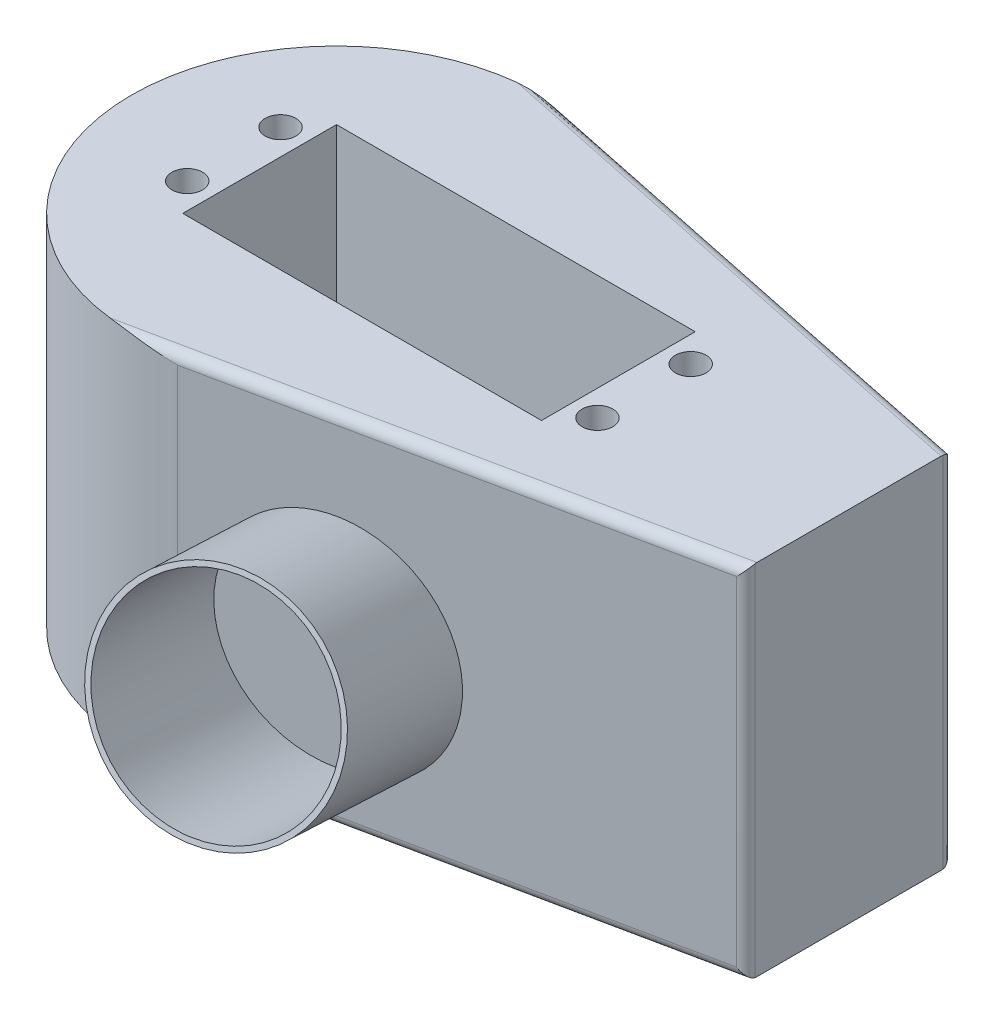
ISO-10303-21;
HEADER;
FILE_DESCRIPTION(('STEP AP214'),'2;1');
FILE_NAME('part.step','',(''),(''),'','','');
FILE_SCHEMA(('AUTOMOTIVE_DESIGN { 1 0 10303 214 1 1 1 1 }'));
ENDSEC;
DATA;
#1=APPLICATION_CONTEXT('core data for automotive mechanical design processes');
#2=APPLICATION_PROTOCOL_DEFINITION('international standard','automotive_design',2000,#1);
#3=PRODUCT_CONTEXT('',#1,'mechanical');
#4=PRODUCT('Part','Part','',(#3));
#5=PRODUCT_RELATED_PRODUCT_CATEGORY('part','',(#4));
#6=PRODUCT_DEFINITION_FORMATION('','',#4);
#7=PRODUCT_DEFINITION_CONTEXT('part definition',#1,'design');
#8=PRODUCT_DEFINITION('design','',#6,#7);
#9=PRODUCT_DEFINITION_SHAPE('','',#8);
#10=(LENGTH_UNIT() NAMED_UNIT(*) SI_UNIT(.MILLI.,.METRE.));
#11=(NAMED_UNIT(*) PLANE_ANGLE_UNIT() SI_UNIT($,.RADIAN.));
#12=(NAMED_UNIT(*) SI_UNIT($,.STERADIAN.) SOLID_ANGLE_UNIT());
#13=UNCERTAINTY_MEASURE_WITH_UNIT(LENGTH_MEASURE(1.E-05),#10,'distance_accuracy_value','');
#14=(GEOMETRIC_REPRESENTATION_CONTEXT(3) GLOBAL_UNCERTAINTY_ASSIGNED_CONTEXT((#13)) GLOBAL_UNIT_ASSIGNED_CONTEXT((#10,
#11,#12)) REPRESENTATION_CONTEXT('',''));
#15=CARTESIAN_POINT('',(0.,0.,0.));
#16=DIRECTION('',(0.,0.,1.));
#17=DIRECTION('',(1.,0.,0.));
#18=AXIS2_PLACEMENT_3D('',#15,#16,#17);
#19=CARTESIAN_POINT('',(0.,35.,0.));
#20=DIRECTION('',(0.,-1.,0.));
#21=DIRECTION('',(0.,0.,-1.));
#22=AXIS2_PLACEMENT_3D('',#19,#20,#21);
#23=CYLINDRICAL_SURFACE('',#22,20.);
#24=CARTESIAN_POINT('',(0.,35.,0.));
#25=DIRECTION('',(0.,1.,0.));
#26=DIRECTION('',(0.,0.,1.));
#27=AXIS2_PLACEMENT_3D('',#24,#25,#26);
#28=CIRCLE('',#27,20.);
#29=CARTESIAN_POINT('',(-2.2333107920081,35.,-19.8749169282868));
#30=VERTEX_POINT('',#29);
#31=CARTESIAN_POINT('',(-2.23331079200801,35.,19.8749169282868));
#32=VERTEX_POINT('',#31);
#33=EDGE_CURVE('E193',#30,#32,#28,.T.);
#34=ORIENTED_EDGE('',*,*,#33,.F.);
#35=CARTESIAN_POINT('',(-2.2333107920081,35.,-19.8749169282868));
#36=CARTESIAN_POINT('',(-2.14996907357067,34.9999950767671,-19.8842821194228));
#37=CARTESIAN_POINT('',(-2.06657545336571,34.998971904392,-19.8931218404145));
#38=CARTESIAN_POINT('',(-1.89973454127459,34.9950834396215,-19.9097472148044));
#39=CARTESIAN_POINT('',(-1.81628725619298,34.9922183470935,-19.9175329824565));
#40=CARTESIAN_POINT('',(-1.56602084017619,34.9811560983057,-19.9392981586655));
#41=CARTESIAN_POINT('',(-1.39916930294065,34.9704914609069,-19.95169755197));
#42=CARTESIAN_POINT('',(-1.06584594714027,34.9437956167233,-19.9722764466727));
#43=CARTESIAN_POINT('',(-0.89937391254908,34.9277705786571,-19.9804607713779));
#44=CARTESIAN_POINT('',(-0.566738303896279,34.8912643836755,-19.9926616357295));
#45=CARTESIAN_POINT('',(-0.400574812968353,34.8707821637802,-19.9966771798555));
#46=CARTESIAN_POINT('',(0.12880912232174,34.7995709639229,-20.0028867233304));
#47=CARTESIAN_POINT('',(0.491220352462993,34.7418534786247,-19.9972265078101));
#48=CARTESIAN_POINT('',(1.21313243878854,34.6147822648018,-19.9664467676818));
#49=CARTESIAN_POINT('',(1.57263207802128,34.5454239097918,-19.9413194917743));
#50=CARTESIAN_POINT('',(2.64646781570462,34.3265635659584,-19.8371721412858));
#51=CARTESIAN_POINT('',(3.35617771039226,34.1662703510754,-19.729386913654));
#52=CARTESIAN_POINT('',(4.06628044528256,34.0041146958611,-19.5822738180683));
#53=CARTESIAN_POINT('',(4.07528872144456,34.0020573163557,-19.5804010779713));
#54=CARTESIAN_POINT('',(4.08429556936661,34.,-19.5785221531671));
#55=B_SPLINE_CURVE_WITH_KNOTS('',3,(#35,#36,#37,#38,#39,#40,#41,#42,#43,#44,#45,#46,#47,#48,#49,
#50,#51,#52,#53,#54),.UNSPECIFIED.,.F.,.F.,(4,2,2,2,2,2,2,2,2,4),(0.,0.251579466841284,
0.50313163929164,1.00591075695465,1.5081132584919,2.01043566031304,3.11052898446587,
4.21106056370022,6.41201196552989,6.44029624320452),.UNSPECIFIED.);
#56=CARTESIAN_POINT('',(4.08429556936661,34.,-19.5785221531671));
#57=VERTEX_POINT('',#56);
#58=EDGE_CURVE('E265',#30,#57,#55,.T.);
#59=ORIENTED_EDGE('',*,*,#58,.T.);
#60=DIRECTION('',(0.,-1.,0.));
#61=VECTOR('',#60,1.);
#62=CARTESIAN_POINT('',(4.08429556936661,35.,-19.5785221531671));
#63=LINE('',#62,#61);
#64=CARTESIAN_POINT('',(4.08429556936661,1.,-19.5785221531671));
#65=VERTEX_POINT('',#64);
#66=EDGE_CURVE('E200',#57,#65,#63,.T.);
#67=ORIENTED_EDGE('',*,*,#66,.T.);
#68=CARTESIAN_POINT('',(-2.2333107920081,0.,-19.8749169282868));
#69=CARTESIAN_POINT('',(-2.14996907357066,4.92323291321938E-06,-19.8842821194228));
#70=CARTESIAN_POINT('',(-2.06657545336569,0.00102809560798968,-19.8931218404145));
#71=CARTESIAN_POINT('',(-1.89973454127456,0.00491656037854574,-19.9097472148044));
#72=CARTESIAN_POINT('',(-1.81628725619293,0.00778165290646679,-19.9175329824565));
#73=CARTESIAN_POINT('',(-1.56602084017612,0.0188439016943405,-19.9392981586655));
#74=CARTESIAN_POINT('',(-1.39916930294056,0.0295085390931102,-19.95169755197));
#75=CARTESIAN_POINT('',(-1.06584594714019,0.0562043832767397,-19.9722764466728));
#76=CARTESIAN_POINT('',(-0.899373912549018,0.0722294213429143,-19.9804607713779));
#77=CARTESIAN_POINT('',(-0.566738303896249,0.108735616324487,-19.9926616357295));
#78=CARTESIAN_POINT('',(-0.400574812968337,0.129217836219819,-19.9966771798555));
#79=CARTESIAN_POINT('',(0.128809122321731,0.200429036077081,-20.0028867233304));
#80=CARTESIAN_POINT('',(0.491220352462968,0.258146521375391,-19.9972265078101));
#81=CARTESIAN_POINT('',(1.21313243878853,0.385217735198094,-19.9664467676818));
#82=CARTESIAN_POINT('',(1.57263207802129,0.454576090207895,-19.9413194917743));
#83=CARTESIAN_POINT('',(2.64646781570446,0.673436434042155,-19.8371721412859));
#84=CARTESIAN_POINT('',(3.35617771039161,0.833729648927437,-19.7293869136542));
#85=CARTESIAN_POINT('',(4.06628044528254,0.995885304138937,-19.5822738180683));
#86=CARTESIAN_POINT('',(4.07528872144455,0.997942683644341,-19.5804010779713));
#87=CARTESIAN_POINT('',(4.08429556936661,1.,-19.5785221531671));
#88=B_SPLINE_CURVE_WITH_KNOTS('',3,(#68,#69,#70,#71,#72,#73,#74,#75,#76,#77,#78,#79,#80,#81,#82,
#83,#84,#85,#86,#87),.UNSPECIFIED.,.F.,.F.,(4,2,2,2,2,2,2,2,2,4),(0.,0.251579466841312,
0.503131639291695,1.00591075695474,1.50811325849194,2.01043566031304,3.11052898446585,
4.21106056370015,6.41201196552988,6.44029624320452),.UNSPECIFIED.);
#89=CARTESIAN_POINT('',(-2.2333107920081,0.,-19.8749169282868));
#90=VERTEX_POINT('',#89);
#91=EDGE_CURVE('E260',#65,#90,#88,.F.);
#92=ORIENTED_EDGE('',*,*,#91,.T.);
#93=CARTESIAN_POINT('',(0.,0.,0.));
#94=DIRECTION('',(0.,1.,0.));
#95=DIRECTION('',(0.,0.,1.));
#96=AXIS2_PLACEMENT_3D('',#93,#94,#95);
#97=CIRCLE('',#96,20.);
#98=CARTESIAN_POINT('',(-2.23331079200801,0.,19.8749169282868));
#99=VERTEX_POINT('',#98);
#100=EDGE_CURVE('E189',#90,#99,#97,.T.);
#101=ORIENTED_EDGE('',*,*,#100,.T.);
#102=CARTESIAN_POINT('',(-2.23331079200801,0.,19.8749169282868));
#103=CARTESIAN_POINT('',(-2.14996907357087,4.92323291404994E-06,19.8842821194228));
#104=CARTESIAN_POINT('',(-2.06657545336621,0.00102809560798251,19.8931218404145));
#105=CARTESIAN_POINT('',(-1.89973454127568,0.0049165603785101,19.9097472148043));
#106=CARTESIAN_POINT('',(-1.81628725619435,0.00778165290641066,19.9175329824564));
#107=CARTESIAN_POINT('',(-1.56602084017832,0.0188439016942181,19.9392981586653));
#108=CARTESIAN_POINT('',(-1.39916930294323,0.0295085390929363,19.9516975519699));
#109=CARTESIAN_POINT('',(-1.06584594714275,0.0562043832764792,19.9722764466726));
#110=CARTESIAN_POINT('',(-0.899373912550984,0.0722294213426524,19.9804607713778));
#111=CARTESIAN_POINT('',(-0.56673830389716,0.108735616324409,19.9926616357295));
#112=CARTESIAN_POINT('',(-0.400574812968781,0.129217836219924,19.9966771798555));
#113=CARTESIAN_POINT('',(0.128809122322076,0.200429036076712,20.0028867233304));
#114=CARTESIAN_POINT('',(0.491220352463886,0.258146521373204,19.99722650781));
#115=CARTESIAN_POINT('',(1.21313243878912,0.385217735200495,19.9664467676819));
#116=CARTESIAN_POINT('',(1.57263207802099,0.454576090216713,19.9413194917747));
#117=CARTESIAN_POINT('',(2.64646781570955,0.673436434025294,19.8371721412848));
#118=CARTESIAN_POINT('',(3.3561777104127,0.833729648833817,19.7293869136492));
#119=CARTESIAN_POINT('',(4.06628044528312,0.995885304136537,19.5822738180682));
#120=CARTESIAN_POINT('',(4.07528872144487,0.997942683643127,19.5804010779713));
#121=CARTESIAN_POINT('',(4.08429556936667,1.,19.5785221531671));
#122=B_SPLINE_CURVE_WITH_KNOTS('',3,(#102,#103,#104,#105,#106,#107,#108,#109,#110,#111,#112,
#113,#114,#115,#116,#117,#118,#119,#120,#121),.UNSPECIFIED.,.F.,.F.,(4,2,2,2,2,2,2,2,2,4),(0.,
0.251579466840401,0.503131639289871,1.0059107569515,1.50811325849044,2.01043566031304,
3.11052898446637,4.21106056370213,6.41201196552987,6.4402962432045),.UNSPECIFIED.);
#123=CARTESIAN_POINT('',(4.08429556936663,1.,19.5785221531671));
#124=VERTEX_POINT('',#123);
#125=EDGE_CURVE('E233',#99,#124,#122,.T.);
#126=ORIENTED_EDGE('',*,*,#125,.T.);
#127=DIRECTION('',(0.,-1.,0.));
#128=VECTOR('',#127,1.);
#129=CARTESIAN_POINT('',(4.08429556936663,35.,19.5785221531671));
#130=LINE('',#129,#128);
#131=CARTESIAN_POINT('',(4.08429556936663,34.,19.5785221531671));
#132=VERTEX_POINT('',#131);
#133=EDGE_CURVE('E207',#132,#124,#130,.T.);
#134=ORIENTED_EDGE('',*,*,#133,.F.);
#135=CARTESIAN_POINT('',(-2.23331079200801,35.,19.8749169282868));
#136=CARTESIAN_POINT('',(-2.14996907357093,34.9999950767671,19.8842821194228));
#137=CARTESIAN_POINT('',(-2.06657545336633,34.998971904392,19.8931218404145));
#138=CARTESIAN_POINT('',(-1.89973454127592,34.9950834396215,19.9097472148043));
#139=CARTESIAN_POINT('',(-1.81628725619466,34.9922183470936,19.9175329824564));
#140=CARTESIAN_POINT('',(-1.56602084017878,34.9811560983058,19.9392981586652));
#141=CARTESIAN_POINT('',(-1.39916930294379,34.9704914609071,19.9516975519698));
#142=CARTESIAN_POINT('',(-1.06584594714328,34.9437956167236,19.9722764466726));
#143=CARTESIAN_POINT('',(-0.899373912551401,34.9277705786574,19.9804607713778));
#144=CARTESIAN_POINT('',(-0.566738303897362,34.8912643836756,19.9926616357295));
#145=CARTESIAN_POINT('',(-0.400574812968888,34.8707821637801,19.9966771798555));
#146=CARTESIAN_POINT('',(0.128809122322126,34.7995709639234,20.0028867233304));
#147=CARTESIAN_POINT('',(0.491220352464049,34.7418534786272,19.99722650781));
#148=CARTESIAN_POINT('',(1.21313243878922,34.614782264799,19.9664467676819));
#149=CARTESIAN_POINT('',(1.5726320780209,34.5454239097815,19.9413194917747));
#150=CARTESIAN_POINT('',(2.64646781571053,34.326563565978,19.8371721412846));
#151=CARTESIAN_POINT('',(3.35617771041687,34.1662703511847,19.7293869136484));
#152=CARTESIAN_POINT('',(4.06628044528317,34.0041146958639,19.5822738180682));
#153=CARTESIAN_POINT('',(4.07528872144488,34.0020573163571,19.5804010779713));
#154=CARTESIAN_POINT('',(4.08429556936663,34.,19.5785221531671));
#155=B_SPLINE_CURVE_WITH_KNOTS('',3,(#135,#136,#137,#138,#139,#140,#141,#142,#143,#144,#145,
#146,#147,#148,#149,#150,#151,#152,#153,#154),.UNSPECIFIED.,.F.,.F.,(4,2,2,2,2,2,2,2,2,4),(0.,
0.251579466840216,0.503131639289501,1.00591075695084,1.50811325849014,2.01043566031304,
3.11052898446647,4.21106056370253,6.41201196552981,6.44029624320447),.UNSPECIFIED.);
#156=EDGE_CURVE('E240',#132,#32,#155,.F.);
#157=ORIENTED_EDGE('',*,*,#156,.T.);
#158=EDGE_LOOP('',(#34,#59,#67,#92,#101,#126,#134,#157));
#159=FACE_BOUND('',#158,.T.);
#160=ADVANCED_FACE('F44',(#159),#23,.T.);
#161=CARTESIAN_POINT('',(50.,35.,9.99999999999999));
#162=DIRECTION('',(-0.204214778468331,0.,-0.978926107658352));
#163=DIRECTION('',(-0.978926107658352,0.,0.204214778468331));
#164=AXIS2_PLACEMENT_3D('',#161,#162,#163);
#165=PLANE('',#164);
#166=CARTESIAN_POINT('',(16.7947498943146,15.4452766950134,16.926981251464));
#167=DIRECTION('',(-0.204214778468331,0.,-0.978926107658352));
#168=DIRECTION('',(-0.108974946633632,-0.99378451117643,0.0227333752887835));
#169=AXIS2_PLACEMENT_3D('',#166,#167,#168);
#170=ELLIPSE('',#169,10.8799883148223,10.5);
#171=CARTESIAN_POINT('',(15.6091037483323,4.63291282596247,17.1743201089625));
#172=VERTEX_POINT('',#171);
#173=EDGE_CURVE('E12',#172,#172,#170,.F.);
#174=ORIENTED_EDGE('',*,*,#173,.F.);
#175=EDGE_LOOP('',(#174));
#176=FACE_BOUND('',#175,.T.);
#177=DIRECTION('',(0.,-1.,0.));
#178=VECTOR('',#177,1.);
#179=CARTESIAN_POINT('',(49.2042147784683,35.,10.1660095705407));
#180=LINE('',#179,#178);
#181=CARTESIAN_POINT('',(49.2042147784683,1.,10.1660095705407));
#182=VERTEX_POINT('',#181);
#183=CARTESIAN_POINT('',(49.2042147784683,34.,10.1660095705407));
#184=VERTEX_POINT('',#183);
#185=EDGE_CURVE('E60',#182,#184,#180,.F.);
#186=ORIENTED_EDGE('',*,*,#185,.T.);
#187=DIRECTION('',(0.978926107658352,0.,-0.204214778468331));
#188=VECTOR('',#187,1.);
#189=CARTESIAN_POINT('',(4.08429556936663,34.,19.5785221531671));
#190=LINE('',#189,#188);
#191=EDGE_CURVE('E53',#184,#132,#190,.F.);
#192=ORIENTED_EDGE('',*,*,#191,.T.);
#193=ORIENTED_EDGE('',*,*,#133,.T.);
#194=DIRECTION('',(0.978926107658352,0.,-0.204214778468331));
#195=VECTOR('',#194,1.);
#196=CARTESIAN_POINT('',(50.,1.,9.99999999999999));
#197=LINE('',#196,#195);
#198=EDGE_CURVE('E65',#124,#182,#197,.T.);
#199=ORIENTED_EDGE('',*,*,#198,.T.);
#200=EDGE_LOOP('',(#186,#192,#193,#199));
#201=FACE_BOUND('',#200,.T.);
#202=ADVANCED_FACE('F251',(#176,#201),#165,.F.);
#203=CARTESIAN_POINT('',(50.,35.,-10.));
#204=DIRECTION('',(-1.,0.,0.));
#205=DIRECTION('',(0.,0.,1.));
#206=AXIS2_PLACEMENT_3D('',#203,#204,#205);
#207=PLANE('',#206);
#208=DIRECTION('',(0.,-1.,0.));
#209=VECTOR('',#208,1.);
#210=CARTESIAN_POINT('',(50.,35.,-9.18708346288237));
#211=LINE('',#210,#209);
#212=CARTESIAN_POINT('',(50.,0.0210738923416484,-9.18708346288237));
#213=VERTEX_POINT('',#212);
#214=CARTESIAN_POINT('',(50.,34.9789261076584,-9.18708346288237));
#215=VERTEX_POINT('',#214);
#216=EDGE_CURVE('E224',#213,#215,#211,.F.);
#217=ORIENTED_EDGE('',*,*,#216,.T.);
#218=CARTESIAN_POINT('',(50.,34.,-8.97847243813728));
#219=DIRECTION('',(-1.,0.,0.));
#220=DIRECTION('',(0.,0.,1.));
#221=AXIS2_PLACEMENT_3D('',#218,#219,#220);
#222=ELLIPSE('',#221,1.02152756186272,1.);
#223=CARTESIAN_POINT('',(50.,35.,-8.97847243813728));
#224=VERTEX_POINT('',#223);
#225=EDGE_CURVE('E226',#215,#224,#222,.F.);
#226=ORIENTED_EDGE('',*,*,#225,.T.);
#227=DIRECTION('',(0.,0.,-1.));
#228=VECTOR('',#227,1.);
#229=CARTESIAN_POINT('',(50.,35.,-10.));
#230=LINE('',#229,#228);
#231=CARTESIAN_POINT('',(50.,35.,8.97847243813727));
#232=VERTEX_POINT('',#231);
#233=EDGE_CURVE('E196',#232,#224,#230,.T.);
#234=ORIENTED_EDGE('',*,*,#233,.F.);
#235=CARTESIAN_POINT('',(50.,34.,8.97847243813727));
#236=DIRECTION('',(-1.,0.,0.));
#237=DIRECTION('',(0.,0.,1.));
#238=AXIS2_PLACEMENT_3D('',#235,#236,#237);
#239=ELLIPSE('',#238,1.02152756186272,1.);
#240=CARTESIAN_POINT('',(50.,34.9789261076584,9.18708346288236));
#241=VERTEX_POINT('',#240);
#242=EDGE_CURVE('E220',#232,#241,#239,.F.);
#243=ORIENTED_EDGE('',*,*,#242,.T.);
#244=DIRECTION('',(0.,-1.,0.));
#245=VECTOR('',#244,1.);
#246=CARTESIAN_POINT('',(50.,35.,9.18708346288236));
#247=LINE('',#246,#245);
#248=CARTESIAN_POINT('',(50.,0.0210738923416484,9.18708346288236));
#249=VERTEX_POINT('',#248);
#250=EDGE_CURVE('E218',#241,#249,#247,.T.);
#251=ORIENTED_EDGE('',*,*,#250,.T.);
#252=CARTESIAN_POINT('',(50.,1.,8.97847243813727));
#253=DIRECTION('',(-1.,0.,0.));
#254=DIRECTION('',(0.,0.,-1.));
#255=AXIS2_PLACEMENT_3D('',#252,#253,#254);
#256=ELLIPSE('',#255,1.02152756186272,1.);
#257=CARTESIAN_POINT('',(50.,0.,8.97847243813728));
#258=VERTEX_POINT('',#257);
#259=EDGE_CURVE('E216',#249,#258,#256,.F.);
#260=ORIENTED_EDGE('',*,*,#259,.T.);
#261=DIRECTION('',(0.,0.,-1.));
#262=VECTOR('',#261,1.);
#263=CARTESIAN_POINT('',(50.,0.,-10.));
#264=LINE('',#263,#262);
#265=CARTESIAN_POINT('',(50.,0.,-8.97847243813728));
#266=VERTEX_POINT('',#265);
#267=EDGE_CURVE('E197',#258,#266,#264,.T.);
#268=ORIENTED_EDGE('',*,*,#267,.T.);
#269=CARTESIAN_POINT('',(50.,1.,-8.97847243813728));
#270=DIRECTION('',(-1.,0.,0.));
#271=DIRECTION('',(0.,0.,-1.));
#272=AXIS2_PLACEMENT_3D('',#269,#270,#271);
#273=ELLIPSE('',#272,1.02152756186272,1.);
#274=EDGE_CURVE('E222',#266,#213,#273,.F.);
#275=ORIENTED_EDGE('',*,*,#274,.T.);
#276=EDGE_LOOP('',(#217,#226,#234,#243,#251,#260,#268,#275));
#277=FACE_BOUND('',#276,.T.);
#278=ADVANCED_FACE('F363',(#277),#207,.F.);
#279=CARTESIAN_POINT('',(4.08429556936661,35.,-19.5785221531671));
#280=DIRECTION('',(-0.20421477846833,0.,0.978926107658352));
#281=DIRECTION('',(0.978926107658352,0.,0.20421477846833));
#282=AXIS2_PLACEMENT_3D('',#279,#280,#281);
#283=PLANE('',#282);
#284=ORIENTED_EDGE('',*,*,#66,.F.);
#285=DIRECTION('',(-0.978926107658352,0.,-0.20421477846833));
#286=VECTOR('',#285,1.);
#287=CARTESIAN_POINT('',(50.,34.,-10.));
#288=LINE('',#287,#286);
#289=CARTESIAN_POINT('',(49.2042147784683,34.,-10.1660095705407));
#290=VERTEX_POINT('',#289);
#291=EDGE_CURVE('E214',#57,#290,#288,.F.);
#292=ORIENTED_EDGE('',*,*,#291,.T.);
#293=DIRECTION('',(0.,-1.,0.));
#294=VECTOR('',#293,1.);
#295=CARTESIAN_POINT('',(49.2042147784683,35.,-10.1660095705407));
#296=LINE('',#295,#294);
#297=CARTESIAN_POINT('',(49.2042147784683,1.,-10.1660095705407));
#298=VERTEX_POINT('',#297);
#299=EDGE_CURVE('E211',#290,#298,#296,.T.);
#300=ORIENTED_EDGE('',*,*,#299,.T.);
#301=DIRECTION('',(-0.978926107658352,0.,-0.20421477846833));
#302=VECTOR('',#301,1.);
#303=CARTESIAN_POINT('',(4.08429556936661,1.,-19.5785221531671));
#304=LINE('',#303,#302);
#305=EDGE_CURVE('E209',#298,#65,#304,.T.);
#306=ORIENTED_EDGE('',*,*,#305,.T.);
#307=EDGE_LOOP('',(#284,#292,#300,#306));
#308=FACE_BOUND('',#307,.T.);
#309=ADVANCED_FACE('F375',(#308),#283,.F.);
#310=CARTESIAN_POINT('',(0.,35.,0.));
#311=DIRECTION('',(0.,1.,0.));
#312=DIRECTION('',(0.,0.,1.));
#313=AXIS2_PLACEMENT_3D('',#310,#311,#312);
#314=PLANE('',#313);
#315=CARTESIAN_POINT('',(30.01,35.,-4.55));
#316=DIRECTION('',(0.,1.,0.));
#317=DIRECTION('',(0.,0.,-1.));
#318=AXIS2_PLACEMENT_3D('',#315,#316,#317);
#319=CIRCLE('',#318,1.5);
#320=CARTESIAN_POINT('',(30.01,35.,-6.05));
#321=VERTEX_POINT('',#320);
#322=EDGE_CURVE('E613',#321,#321,#319,.T.);
#323=ORIENTED_EDGE('',*,*,#322,.F.);
#324=EDGE_LOOP('',(#323));
#325=FACE_BOUND('',#324,.T.);
#326=CARTESIAN_POINT('',(30.01,35.,4.54999999999999));
#327=DIRECTION('',(0.,1.,0.));
#328=DIRECTION('',(0.,0.,1.));
#329=AXIS2_PLACEMENT_3D('',#326,#327,#328);
#330=CIRCLE('',#329,1.5);
#331=CARTESIAN_POINT('',(30.01,35.,6.04999999999999));
#332=VERTEX_POINT('',#331);
#333=EDGE_CURVE('E612',#332,#332,#330,.T.);
#334=ORIENTED_EDGE('',*,*,#333,.F.);
#335=EDGE_LOOP('',(#334));
#336=FACE_BOUND('',#335,.T.);
#337=CARTESIAN_POINT('',(-10.01,35.,4.55));
#338=DIRECTION('',(0.,1.,0.));
#339=DIRECTION('',(0.,0.,-1.));
#340=AXIS2_PLACEMENT_3D('',#337,#338,#339);
#341=CIRCLE('',#340,1.5);
#342=CARTESIAN_POINT('',(-10.01,35.,3.05));
#343=VERTEX_POINT('',#342);
#344=EDGE_CURVE('E629',#343,#343,#341,.T.);
#345=ORIENTED_EDGE('',*,*,#344,.F.);
#346=EDGE_LOOP('',(#345));
#347=FACE_BOUND('',#346,.T.);
#348=CARTESIAN_POINT('',(-10.01,35.,-4.55));
#349=DIRECTION('',(0.,1.,0.));
#350=DIRECTION('',(0.,0.,1.));
#351=AXIS2_PLACEMENT_3D('',#348,#349,#350);
#352=CIRCLE('',#351,1.5);
#353=CARTESIAN_POINT('',(-10.01,35.,-3.05));
#354=VERTEX_POINT('',#353);
#355=EDGE_CURVE('E623',#354,#354,#352,.T.);
#356=ORIENTED_EDGE('',*,*,#355,.F.);
#357=EDGE_LOOP('',(#356));
#358=FACE_BOUND('',#357,.T.);
#359=DIRECTION('',(0.,0.,1.));
#360=VECTOR('',#359,1.);
#361=CARTESIAN_POINT('',(-7.5,35.,-7.5));
#362=LINE('',#361,#360);
#363=CARTESIAN_POINT('',(-7.5,35.,-7.5));
#364=VERTEX_POINT('',#363);
#365=CARTESIAN_POINT('',(-7.5,35.,7.5));
#366=VERTEX_POINT('',#365);
#367=EDGE_CURVE('E153',#364,#366,#362,.T.);
#368=ORIENTED_EDGE('',*,*,#367,.F.);
#369=DIRECTION('',(-1.,0.,0.));
#370=VECTOR('',#369,1.);
#371=CARTESIAN_POINT('',(-7.5,35.,-7.5));
#372=LINE('',#371,#370);
#373=CARTESIAN_POINT('',(27.5,35.,-7.5));
#374=VERTEX_POINT('',#373);
#375=EDGE_CURVE('E170',#374,#364,#372,.T.);
#376=ORIENTED_EDGE('',*,*,#375,.F.);
#377=DIRECTION('',(0.,0.,-1.));
#378=VECTOR('',#377,1.);
#379=CARTESIAN_POINT('',(27.5,35.,-7.5));
#380=LINE('',#379,#378);
#381=CARTESIAN_POINT('',(27.5,35.,7.49999999999999));
#382=VERTEX_POINT('',#381);
#383=EDGE_CURVE('E173',#382,#374,#380,.T.);
#384=ORIENTED_EDGE('',*,*,#383,.F.);
#385=DIRECTION('',(1.,0.,0.));
#386=VECTOR('',#385,1.);
#387=CARTESIAN_POINT('',(-7.5,35.,7.5));
#388=LINE('',#387,#386);
#389=EDGE_CURVE('E182',#366,#382,#388,.T.);
#390=ORIENTED_EDGE('',*,*,#389,.F.);
#391=EDGE_LOOP('',(#368,#376,#384,#390));
#392=FACE_BOUND('',#391,.T.);
#393=ORIENTED_EDGE('',*,*,#233,.T.);
#394=DIRECTION('',(-0.978926107658352,0.,-0.20421477846833));
#395=VECTOR('',#394,1.);
#396=CARTESIAN_POINT('',(3.88008079089828,35.,-18.5995960455087));
#397=LINE('',#396,#395);
#398=EDGE_CURVE('E231',#224,#30,#397,.T.);
#399=ORIENTED_EDGE('',*,*,#398,.T.);
#400=ORIENTED_EDGE('',*,*,#33,.T.);
#401=DIRECTION('',(0.978926107658352,0.,-0.204214778468331));
#402=VECTOR('',#401,1.);
#403=CARTESIAN_POINT('',(49.7957852215317,35.,9.02107389234164));
#404=LINE('',#403,#402);
#405=EDGE_CURVE('E228',#32,#232,#404,.T.);
#406=ORIENTED_EDGE('',*,*,#405,.T.);
#407=EDGE_LOOP('',(#393,#399,#400,#406));
#408=FACE_BOUND('',#407,.T.);
#409=ADVANCED_FACE('F335',(#325,#336,#347,#358,#392,#408),#314,.T.);
#410=CARTESIAN_POINT('',(0.,0.,0.));
#411=DIRECTION('',(0.,1.,0.));
#412=DIRECTION('',(0.,0.,1.));
#413=AXIS2_PLACEMENT_3D('',#410,#411,#412);
#414=PLANE('',#413);
#415=CARTESIAN_POINT('',(0.,0.,0.));
#416=DIRECTION('',(0.,-1.,0.));
#417=DIRECTION('',(0.,0.,-1.));
#418=AXIS2_PLACEMENT_3D('',#415,#416,#417);
#419=CIRCLE('',#418,7.5);
#420=CARTESIAN_POINT('',(0.,0.,-7.5));
#421=VERTEX_POINT('',#420);
#422=EDGE_CURVE('E176',#421,#421,#419,.T.);
#423=ORIENTED_EDGE('',*,*,#422,.F.);
#424=EDGE_LOOP('',(#423));
#425=FACE_BOUND('',#424,.T.);
#426=ORIENTED_EDGE('',*,*,#100,.F.);
#427=DIRECTION('',(-0.978926107658352,0.,-0.20421477846833));
#428=VECTOR('',#427,1.);
#429=CARTESIAN_POINT('',(3.88008079089828,0.,-18.5995960455087));
#430=LINE('',#429,#428);
#431=EDGE_CURVE('E340',#90,#266,#430,.F.);
#432=ORIENTED_EDGE('',*,*,#431,.T.);
#433=ORIENTED_EDGE('',*,*,#267,.F.);
#434=DIRECTION('',(0.978926107658352,0.,-0.204214778468331));
#435=VECTOR('',#434,1.);
#436=CARTESIAN_POINT('',(3.8800807908983,0.,18.5995960455087));
#437=LINE('',#436,#435);
#438=EDGE_CURVE('E342',#258,#99,#437,.F.);
#439=ORIENTED_EDGE('',*,*,#438,.T.);
#440=EDGE_LOOP('',(#426,#432,#433,#439));
#441=FACE_BOUND('',#440,.T.);
#442=ADVANCED_FACE('F332',(#425,#441),#414,.F.);
#443=CARTESIAN_POINT('',(-7.5,20.,-7.5));
#444=DIRECTION('',(-1.,0.,0.));
#445=DIRECTION('',(0.,0.,1.));
#446=AXIS2_PLACEMENT_3D('',#443,#444,#445);
#447=PLANE('',#446);
#448=ORIENTED_EDGE('',*,*,#367,.T.);
#449=DIRECTION('',(0.,1.,0.));
#450=VECTOR('',#449,1.);
#451=CARTESIAN_POINT('',(-7.5,20.,7.5));
#452=LINE('',#451,#450);
#453=CARTESIAN_POINT('',(-7.5,20.,7.5));
#454=VERTEX_POINT('',#453);
#455=EDGE_CURVE('E146',#454,#366,#452,.T.);
#456=ORIENTED_EDGE('',*,*,#455,.F.);
#457=DIRECTION('',(0.,0.,1.));
#458=VECTOR('',#457,1.);
#459=CARTESIAN_POINT('',(-7.5,20.,-7.5));
#460=LINE('',#459,#458);
#461=CARTESIAN_POINT('',(-7.5,20.,-7.5));
#462=VERTEX_POINT('',#461);
#463=EDGE_CURVE('E150',#462,#454,#460,.T.);
#464=ORIENTED_EDGE('',*,*,#463,.F.);
#465=DIRECTION('',(0.,1.,0.));
#466=VECTOR('',#465,1.);
#467=CARTESIAN_POINT('',(-7.5,20.,-7.5));
#468=LINE('',#467,#466);
#469=EDGE_CURVE('E187',#462,#364,#468,.T.);
#470=ORIENTED_EDGE('',*,*,#469,.T.);
#471=EDGE_LOOP('',(#448,#456,#464,#470));
#472=FACE_BOUND('',#471,.T.);
#473=ADVANCED_FACE('F148',(#472),#447,.F.);
#474=CARTESIAN_POINT('',(-7.5,20.,-7.5));
#475=DIRECTION('',(0.,0.,-1.));
#476=DIRECTION('',(-1.,0.,0.));
#477=AXIS2_PLACEMENT_3D('',#474,#475,#476);
#478=PLANE('',#477);
#479=ORIENTED_EDGE('',*,*,#375,.T.);
#480=ORIENTED_EDGE('',*,*,#469,.F.);
#481=DIRECTION('',(-1.,0.,0.));
#482=VECTOR('',#481,1.);
#483=CARTESIAN_POINT('',(-7.5,20.,-7.5));
#484=LINE('',#483,#482);
#485=CARTESIAN_POINT('',(27.5,20.,-7.5));
#486=VERTEX_POINT('',#485);
#487=EDGE_CURVE('E158',#486,#462,#484,.T.);
#488=ORIENTED_EDGE('',*,*,#487,.F.);
#489=DIRECTION('',(0.,1.,0.));
#490=VECTOR('',#489,1.);
#491=CARTESIAN_POINT('',(27.5,20.,-7.5));
#492=LINE('',#491,#490);
#493=EDGE_CURVE('E190',#486,#374,#492,.T.);
#494=ORIENTED_EDGE('',*,*,#493,.T.);
#495=EDGE_LOOP('',(#479,#480,#488,#494));
#496=FACE_BOUND('',#495,.T.);
#497=ADVANCED_FACE('F414',(#496),#478,.F.);
#498=CARTESIAN_POINT('',(27.5,20.,-7.5));
#499=DIRECTION('',(1.,0.,0.));
#500=DIRECTION('',(0.,0.,-1.));
#501=AXIS2_PLACEMENT_3D('',#498,#499,#500);
#502=PLANE('',#501);
#503=ORIENTED_EDGE('',*,*,#383,.T.);
#504=ORIENTED_EDGE('',*,*,#493,.F.);
#505=DIRECTION('',(0.,0.,-1.));
#506=VECTOR('',#505,1.);
#507=CARTESIAN_POINT('',(27.5,20.,-7.5));
#508=LINE('',#507,#506);
#509=CARTESIAN_POINT('',(27.5,20.,7.49999999999999));
#510=VERTEX_POINT('',#509);
#511=EDGE_CURVE('E166',#510,#486,#508,.T.);
#512=ORIENTED_EDGE('',*,*,#511,.F.);
#513=DIRECTION('',(0.,1.,0.));
#514=VECTOR('',#513,1.);
#515=CARTESIAN_POINT('',(27.5,20.,7.49999999999999));
#516=LINE('',#515,#514);
#517=EDGE_CURVE('E157',#510,#382,#516,.T.);
#518=ORIENTED_EDGE('',*,*,#517,.T.);
#519=EDGE_LOOP('',(#503,#504,#512,#518));
#520=FACE_BOUND('',#519,.T.);
#521=ADVANCED_FACE('F417',(#520),#502,.F.);
#522=CARTESIAN_POINT('',(-7.5,20.,7.5));
#523=DIRECTION('',(0.,0.,1.));
#524=DIRECTION('',(1.,0.,0.));
#525=AXIS2_PLACEMENT_3D('',#522,#523,#524);
#526=PLANE('',#525);
#527=ORIENTED_EDGE('',*,*,#389,.T.);
#528=ORIENTED_EDGE('',*,*,#517,.F.);
#529=DIRECTION('',(1.,0.,0.));
#530=VECTOR('',#529,1.);
#531=CARTESIAN_POINT('',(-7.5,20.,7.5));
#532=LINE('',#531,#530);
#533=EDGE_CURVE('E161',#454,#510,#532,.T.);
#534=ORIENTED_EDGE('',*,*,#533,.F.);
#535=ORIENTED_EDGE('',*,*,#455,.T.);
#536=EDGE_LOOP('',(#527,#528,#534,#535));
#537=FACE_BOUND('',#536,.T.);
#538=ADVANCED_FACE('F162',(#537),#526,.F.);
#539=CARTESIAN_POINT('',(0.,20.,0.));
#540=DIRECTION('',(0.,1.,0.));
#541=DIRECTION('',(0.,0.,1.));
#542=AXIS2_PLACEMENT_3D('',#539,#540,#541);
#543=PLANE('',#542);
#544=CARTESIAN_POINT('',(0.,20.,0.));
#545=DIRECTION('',(0.,1.,0.));
#546=DIRECTION('',(0.,0.,1.));
#547=AXIS2_PLACEMENT_3D('',#544,#545,#546);
#548=CIRCLE('',#547,3.);
#549=CARTESIAN_POINT('',(0.,20.,3.));
#550=VERTEX_POINT('',#549);
#551=EDGE_CURVE('E308',#550,#550,#548,.T.);
#552=ORIENTED_EDGE('',*,*,#551,.F.);
#553=EDGE_LOOP('',(#552));
#554=FACE_BOUND('',#553,.T.);
#555=ORIENTED_EDGE('',*,*,#463,.T.);
#556=ORIENTED_EDGE('',*,*,#533,.T.);
#557=ORIENTED_EDGE('',*,*,#511,.T.);
#558=ORIENTED_EDGE('',*,*,#487,.T.);
#559=EDGE_LOOP('',(#555,#556,#557,#558));
#560=FACE_BOUND('',#559,.T.);
#561=ADVANCED_FACE('F168',(#554,#560),#543,.T.);
#562=CARTESIAN_POINT('',(3.88008079089828,34.,-18.5995960455087));
#563=DIRECTION('',(0.978926107658352,0.,0.20421477846833));
#564=DIRECTION('',(0.20421477846833,0.,-0.978926107658352));
#565=AXIS2_PLACEMENT_3D('',#562,#563,#564);
#566=CYLINDRICAL_SURFACE('',#565,1.);
#567=ORIENTED_EDGE('',*,*,#398,.F.);
#568=ORIENTED_EDGE('',*,*,#225,.F.);
#569=CARTESIAN_POINT('',(49.,34.,-9.18708346288237));
#570=DIRECTION('',(0.692205289005773,-0.707106781186547,0.144401654673465));
#571=DIRECTION('',(0.692205289005773,0.707106781186547,0.144401654673465));
#572=AXIS2_PLACEMENT_3D('',#569,#570,#571);
#573=ELLIPSE('',#572,1.41421356237309,1.);
#574=EDGE_CURVE('E183',#290,#215,#573,.T.);
#575=ORIENTED_EDGE('',*,*,#574,.F.);
#576=ORIENTED_EDGE('',*,*,#291,.F.);
#577=ORIENTED_EDGE('',*,*,#58,.F.);
#578=EDGE_LOOP('',(#567,#568,#575,#576,#577));
#579=FACE_BOUND('',#578,.T.);
#580=ADVANCED_FACE('F275',(#579),#566,.T.);
#581=CARTESIAN_POINT('',(3.88008079089828,1.,-18.5995960455087));
#582=DIRECTION('',(-0.978926107658352,0.,-0.20421477846833));
#583=DIRECTION('',(-0.20421477846833,0.,0.978926107658352));
#584=AXIS2_PLACEMENT_3D('',#581,#582,#583);
#585=CYLINDRICAL_SURFACE('',#584,1.);
#586=ORIENTED_EDGE('',*,*,#91,.F.);
#587=ORIENTED_EDGE('',*,*,#305,.F.);
#588=CARTESIAN_POINT('',(49.,1.,-9.18708346288237));
#589=DIRECTION('',(-0.692205289005773,-0.707106781186547,-0.144401654673465));
#590=DIRECTION('',(-0.692205289005773,0.707106781186547,-0.144401654673465));
#591=AXIS2_PLACEMENT_3D('',#588,#589,#590);
#592=ELLIPSE('',#591,1.41421356237309,1.);
#593=EDGE_CURVE('E298',#213,#298,#592,.F.);
#594=ORIENTED_EDGE('',*,*,#593,.F.);
#595=ORIENTED_EDGE('',*,*,#274,.F.);
#596=ORIENTED_EDGE('',*,*,#431,.F.);
#597=EDGE_LOOP('',(#586,#587,#594,#595,#596));
#598=FACE_BOUND('',#597,.T.);
#599=ADVANCED_FACE('F272',(#598),#585,.T.);
#600=CARTESIAN_POINT('',(49.,35.,-9.18708346288237));
#601=DIRECTION('',(0.,-1.,0.));
#602=DIRECTION('',(0.,0.,-1.));
#603=AXIS2_PLACEMENT_3D('',#600,#601,#602);
#604=CYLINDRICAL_SURFACE('',#603,1.);
#605=ORIENTED_EDGE('',*,*,#574,.T.);
#606=ORIENTED_EDGE('',*,*,#216,.F.);
#607=ORIENTED_EDGE('',*,*,#593,.T.);
#608=ORIENTED_EDGE('',*,*,#299,.F.);
#609=EDGE_LOOP('',(#605,#606,#607,#608));
#610=FACE_BOUND('',#609,.T.);
#611=ADVANCED_FACE('F254',(#610),#604,.T.);
#612=CARTESIAN_POINT('',(49.7957852215317,1.,9.02107389234164));
#613=DIRECTION('',(0.978926107658352,0.,-0.204214778468331));
#614=DIRECTION('',(-0.204214778468331,0.,-0.978926107658352));
#615=AXIS2_PLACEMENT_3D('',#612,#613,#614);
#616=CYLINDRICAL_SURFACE('',#615,1.);
#617=ORIENTED_EDGE('',*,*,#438,.F.);
#618=ORIENTED_EDGE('',*,*,#259,.F.);
#619=CARTESIAN_POINT('',(49.,1.00000000000001,9.18708346288236));
#620=DIRECTION('',(0.692205289005773,0.707106781186547,-0.144401654673465));
#621=DIRECTION('',(0.692205289005773,-0.707106781186547,-0.144401654673465));
#622=AXIS2_PLACEMENT_3D('',#619,#620,#621);
#623=ELLIPSE('',#622,1.41421356237309,1.);
#624=EDGE_CURVE('E294',#182,#249,#623,.T.);
#625=ORIENTED_EDGE('',*,*,#624,.F.);
#626=ORIENTED_EDGE('',*,*,#198,.F.);
#627=ORIENTED_EDGE('',*,*,#125,.F.);
#628=EDGE_LOOP('',(#617,#618,#625,#626,#627));
#629=FACE_BOUND('',#628,.T.);
#630=ADVANCED_FACE('F46',(#629),#616,.T.);
#631=CARTESIAN_POINT('',(49.,35.,9.18708346288236));
#632=DIRECTION('',(0.,-1.,0.));
#633=DIRECTION('',(0.,0.,-1.));
#634=AXIS2_PLACEMENT_3D('',#631,#632,#633);
#635=CYLINDRICAL_SURFACE('',#634,1.);
#636=ORIENTED_EDGE('',*,*,#624,.T.);
#637=ORIENTED_EDGE('',*,*,#250,.F.);
#638=CARTESIAN_POINT('',(49.,34.,9.18708346288236));
#639=DIRECTION('',(0.692205289005773,-0.707106781186547,-0.144401654673465));
#640=DIRECTION('',(-0.692205289005773,-0.707106781186547,0.144401654673465));
#641=AXIS2_PLACEMENT_3D('',#638,#639,#640);
#642=ELLIPSE('',#641,1.41421356237309,1.);
#643=EDGE_CURVE('E299',#184,#241,#642,.F.);
#644=ORIENTED_EDGE('',*,*,#643,.F.);
#645=ORIENTED_EDGE('',*,*,#185,.F.);
#646=EDGE_LOOP('',(#636,#637,#644,#645));
#647=FACE_BOUND('',#646,.T.);
#648=ADVANCED_FACE('F284',(#647),#635,.T.);
#649=CARTESIAN_POINT('',(3.8800807908983,34.,18.5995960455087));
#650=DIRECTION('',(-0.978926107658352,0.,0.204214778468331));
#651=DIRECTION('',(0.204214778468331,0.,0.978926107658352));
#652=AXIS2_PLACEMENT_3D('',#649,#650,#651);
#653=CYLINDRICAL_SURFACE('',#652,1.);
#654=ORIENTED_EDGE('',*,*,#156,.F.);
#655=ORIENTED_EDGE('',*,*,#191,.F.);
#656=ORIENTED_EDGE('',*,*,#643,.T.);
#657=ORIENTED_EDGE('',*,*,#242,.F.);
#658=ORIENTED_EDGE('',*,*,#405,.F.);
#659=EDGE_LOOP('',(#654,#655,#656,#657,#658));
#660=FACE_BOUND('',#659,.T.);
#661=ADVANCED_FACE('F280',(#660),#653,.T.);
#662=CARTESIAN_POINT('',(0.,10.,0.));
#663=DIRECTION('',(0.,-1.,0.));
#664=DIRECTION('',(0.,0.,-1.));
#665=AXIS2_PLACEMENT_3D('',#662,#663,#664);
#666=CYLINDRICAL_SURFACE('',#665,7.5);
#667=CARTESIAN_POINT('',(0.,10.,0.));
#668=DIRECTION('',(0.,-1.,0.));
#669=DIRECTION('',(0.,0.,-1.));
#670=AXIS2_PLACEMENT_3D('',#667,#668,#669);
#671=CIRCLE('',#670,7.5);
#672=CARTESIAN_POINT('',(0.,10.,-7.5));
#673=VERTEX_POINT('',#672);
#674=EDGE_CURVE('E302',#673,#673,#671,.T.);
#675=ORIENTED_EDGE('',*,*,#674,.F.);
#676=EDGE_LOOP('',(#675));
#677=FACE_BOUND('',#676,.T.);
#678=ORIENTED_EDGE('',*,*,#422,.T.);
#679=EDGE_LOOP('',(#678));
#680=FACE_BOUND('',#679,.T.);
#681=ADVANCED_FACE('F283',(#677,#680),#666,.F.);
#682=CARTESIAN_POINT('',(0.,10.,0.));
#683=DIRECTION('',(0.,-1.,0.));
#684=DIRECTION('',(0.,0.,-1.));
#685=AXIS2_PLACEMENT_3D('',#682,#683,#684);
#686=PLANE('',#685);
#687=CARTESIAN_POINT('',(0.,10.,0.));
#688=DIRECTION('',(0.,-1.,0.));
#689=DIRECTION('',(0.,0.,-1.));
#690=AXIS2_PLACEMENT_3D('',#687,#688,#689);
#691=CIRCLE('',#690,3.);
#692=CARTESIAN_POINT('',(0.,10.,-3.));
#693=VERTEX_POINT('',#692);
#694=EDGE_CURVE('E306',#693,#693,#691,.T.);
#695=ORIENTED_EDGE('',*,*,#694,.F.);
#696=EDGE_LOOP('',(#695));
#697=FACE_BOUND('',#696,.T.);
#698=ORIENTED_EDGE('',*,*,#674,.T.);
#699=EDGE_LOOP('',(#698));
#700=FACE_BOUND('',#699,.T.);
#701=ADVANCED_FACE('F403',(#697,#700),#686,.T.);
#702=CARTESIAN_POINT('',(0.,35.5341352892988,0.));
#703=DIRECTION('',(0.,-1.,0.));
#704=DIRECTION('',(0.,0.,-1.));
#705=AXIS2_PLACEMENT_3D('',#702,#703,#704);
#706=CYLINDRICAL_SURFACE('',#705,3.);
#707=ORIENTED_EDGE('',*,*,#551,.T.);
#708=EDGE_LOOP('',(#707));
#709=FACE_BOUND('',#708,.T.);
#710=ORIENTED_EDGE('',*,*,#694,.T.);
#711=EDGE_LOOP('',(#710));
#712=FACE_BOUND('',#711,.T.);
#713=ADVANCED_FACE('F399',(#709,#712),#706,.F.);
#714=CARTESIAN_POINT('',(20.4697081544808,19.6856669875086,32.217334677882));
#715=DIRECTION('',(-0.225631238099938,-0.260347041786367,-0.938781104532136));
#716=DIRECTION('',(0.,0.963630453208623,-0.267238376078258));
#717=AXIS2_PLACEMENT_3D('',#714,#715,#716);
#718=CYLINDRICAL_SURFACE('',#717,10.5);
#719=CARTESIAN_POINT('',(20.4697081544808,19.6856669875086,32.217334677882));
#720=DIRECTION('',(0.225631238099938,0.260347041786367,0.938781104532136));
#721=DIRECTION('',(0.97421278188776,-0.0602973256623541,-0.217425132228266));
#722=AXIS2_PLACEMENT_3D('',#719,#720,#721);
#723=CIRCLE('',#722,10.5);
#724=CARTESIAN_POINT('',(30.6989423643022,19.0525450680539,29.9343707894852));
#725=VERTEX_POINT('',#724);
#726=EDGE_CURVE('E311',#725,#725,#723,.T.);
#727=ORIENTED_EDGE('',*,*,#726,.F.);
#728=EDGE_LOOP('',(#727));
#729=FACE_BOUND('',#728,.T.);
#730=ORIENTED_EDGE('',*,*,#173,.T.);
#731=EDGE_LOOP('',(#730));
#732=FACE_BOUND('',#731,.T.);
#733=ADVANCED_FACE('F392',(#729,#732),#718,.T.);
#734=CARTESIAN_POINT('',(20.4697081544808,19.6856669875086,32.217334677882));
#735=DIRECTION('',(-0.225631238099938,-0.260347041786367,-0.938781104532136));
#736=DIRECTION('',(0.,0.963630453208623,-0.267238376078258));
#737=AXIS2_PLACEMENT_3D('',#734,#735,#736);
#738=CYLINDRICAL_SURFACE('',#737,9.99999999999999);
#739=CARTESIAN_POINT('',(20.4697081544808,19.6856669875086,32.217334677882));
#740=DIRECTION('',(0.225631238099938,0.260347041786367,0.938781104532136));
#741=DIRECTION('',(0.,-0.963630453208623,0.267238376078258));
#742=AXIS2_PLACEMENT_3D('',#739,#740,#741);
#743=CIRCLE('',#742,9.99999999999999);
#744=CARTESIAN_POINT('',(20.4697081544808,10.0493624554224,34.8897184386646));
#745=VERTEX_POINT('',#744);
#746=EDGE_CURVE('E315',#745,#745,#743,.T.);
#747=ORIENTED_EDGE('',*,*,#746,.T.);
#748=EDGE_LOOP('',(#747));
#749=FACE_BOUND('',#748,.T.);
#750=CARTESIAN_POINT('',(16.7947498943146,15.4452766950134,16.926981251464));
#751=DIRECTION('',(-0.204214778468331,0.,-0.978926107658352));
#752=DIRECTION('',(-0.108974946633632,-0.99378451117643,0.0227333752887835));
#753=AXIS2_PLACEMENT_3D('',#750,#751,#752);
#754=ELLIPSE('',#753,10.3618936331641,9.99999999999999);
#755=CARTESIAN_POINT('',(15.6655630886171,5.14778729591728,17.1625420681292));
#756=VERTEX_POINT('',#755);
#757=EDGE_CURVE('E309',#756,#756,#754,.F.);
#758=ORIENTED_EDGE('',*,*,#757,.F.);
#759=EDGE_LOOP('',(#758));
#760=FACE_BOUND('',#759,.T.);
#761=ADVANCED_FACE('F387',(#749,#760),#738,.F.);
#762=CARTESIAN_POINT('',(20.4697081544808,19.6856669875086,32.217334677882));
#763=DIRECTION('',(0.225631238099938,0.260347041786367,0.938781104532136));
#764=DIRECTION('',(0.,-0.963630453208623,0.267238376078258));
#765=AXIS2_PLACEMENT_3D('',#762,#763,#764);
#766=PLANE('',#765);
#767=ORIENTED_EDGE('',*,*,#726,.T.);
#768=EDGE_LOOP('',(#767));
#769=FACE_BOUND('',#768,.T.);
#770=ORIENTED_EDGE('',*,*,#746,.F.);
#771=EDGE_LOOP('',(#770));
#772=FACE_BOUND('',#771,.T.);
#773=ADVANCED_FACE('F379',(#769,#772),#766,.T.);
#774=ORIENTED_EDGE('',*,*,#757,.T.);
#775=EDGE_LOOP('',(#774));
#776=FACE_BOUND('',#775,.T.);
#777=ADVANCED_FACE('F371',(#776),#165,.F.);
#778=CARTESIAN_POINT('',(-10.01,26.8,-4.55));
#779=DIRECTION('',(0.,1.,0.));
#780=DIRECTION('',(0.,0.,1.));
#781=AXIS2_PLACEMENT_3D('',#778,#779,#780);
#782=CYLINDRICAL_SURFACE('',#781,1.5);
#783=CARTESIAN_POINT('',(-10.01,26.8,-4.55));
#784=DIRECTION('',(0.,1.,0.));
#785=DIRECTION('',(0.,0.,1.));
#786=AXIS2_PLACEMENT_3D('',#783,#784,#785);
#787=CIRCLE('',#786,1.5);
#788=CARTESIAN_POINT('',(-10.01,26.8,-3.05));
#789=VERTEX_POINT('',#788);
#790=EDGE_CURVE('E320',#789,#789,#787,.T.);
#791=ORIENTED_EDGE('',*,*,#790,.F.);
#792=EDGE_LOOP('',(#791));
#793=FACE_BOUND('',#792,.T.);
#794=ORIENTED_EDGE('',*,*,#355,.T.);
#795=EDGE_LOOP('',(#794));
#796=FACE_BOUND('',#795,.T.);
#797=ADVANCED_FACE('F378',(#793,#796),#782,.F.);
#798=CARTESIAN_POINT('',(-10.01,26.8,-4.55));
#799=DIRECTION('',(0.,1.,0.));
#800=DIRECTION('',(0.,0.,1.));
#801=AXIS2_PLACEMENT_3D('',#798,#799,#800);
#802=PLANE('',#801);
#803=ORIENTED_EDGE('',*,*,#790,.T.);
#804=EDGE_LOOP('',(#803));
#805=FACE_BOUND('',#804,.T.);
#806=ADVANCED_FACE('F384',(#805),#802,.T.);
#807=CARTESIAN_POINT('',(-10.01,26.8,4.55));
#808=DIRECTION('',(0.,1.,0.));
#809=DIRECTION('',(0.,0.,1.));
#810=AXIS2_PLACEMENT_3D('',#807,#808,#809);
#811=CYLINDRICAL_SURFACE('',#810,1.5);
#812=CARTESIAN_POINT('',(-10.01,26.8,4.55));
#813=DIRECTION('',(0.,1.,0.));
#814=DIRECTION('',(0.,0.,-1.));
#815=AXIS2_PLACEMENT_3D('',#812,#813,#814);
#816=CIRCLE('',#815,1.5);
#817=CARTESIAN_POINT('',(-10.01,26.8,3.05));
#818=VERTEX_POINT('',#817);
#819=EDGE_CURVE('E625',#818,#818,#816,.T.);
#820=ORIENTED_EDGE('',*,*,#819,.F.);
#821=EDGE_LOOP('',(#820));
#822=FACE_BOUND('',#821,.T.);
#823=ORIENTED_EDGE('',*,*,#344,.T.);
#824=EDGE_LOOP('',(#823));
#825=FACE_BOUND('',#824,.T.);
#826=ADVANCED_FACE('F545',(#822,#825),#811,.F.);
#827=CARTESIAN_POINT('',(-10.01,26.8,4.55));
#828=DIRECTION('',(0.,-1.,0.));
#829=DIRECTION('',(0.,0.,-1.));
#830=AXIS2_PLACEMENT_3D('',#827,#828,#829);
#831=PLANE('',#830);
#832=ORIENTED_EDGE('',*,*,#819,.T.);
#833=EDGE_LOOP('',(#832));
#834=FACE_BOUND('',#833,.T.);
#835=ADVANCED_FACE('F554',(#834),#831,.F.);
#836=CARTESIAN_POINT('',(30.01,26.8,4.54999999999999));
#837=DIRECTION('',(0.,1.,0.));
#838=DIRECTION('',(0.,0.,1.));
#839=AXIS2_PLACEMENT_3D('',#836,#837,#838);
#840=CYLINDRICAL_SURFACE('',#839,1.5);
#841=CARTESIAN_POINT('',(30.01,26.8,4.54999999999999));
#842=DIRECTION('',(0.,1.,0.));
#843=DIRECTION('',(0.,0.,1.));
#844=AXIS2_PLACEMENT_3D('',#841,#842,#843);
#845=CIRCLE('',#844,1.5);
#846=CARTESIAN_POINT('',(30.01,26.8,6.04999999999999));
#847=VERTEX_POINT('',#846);
#848=EDGE_CURVE('E616',#847,#847,#845,.T.);
#849=ORIENTED_EDGE('',*,*,#848,.F.);
#850=EDGE_LOOP('',(#849));
#851=FACE_BOUND('',#850,.T.);
#852=ORIENTED_EDGE('',*,*,#333,.T.);
#853=EDGE_LOOP('',(#852));
#854=FACE_BOUND('',#853,.T.);
#855=ADVANCED_FACE('F563',(#851,#854),#840,.F.);
#856=CARTESIAN_POINT('',(30.01,26.8,4.54999999999999));
#857=DIRECTION('',(0.,1.,0.));
#858=DIRECTION('',(0.,0.,1.));
#859=AXIS2_PLACEMENT_3D('',#856,#857,#858);
#860=PLANE('',#859);
#861=ORIENTED_EDGE('',*,*,#848,.T.);
#862=EDGE_LOOP('',(#861));
#863=FACE_BOUND('',#862,.T.);
#864=ADVANCED_FACE('F572',(#863),#860,.T.);
#865=CARTESIAN_POINT('',(30.01,26.8,-4.55));
#866=DIRECTION('',(0.,1.,0.));
#867=DIRECTION('',(0.,0.,1.));
#868=AXIS2_PLACEMENT_3D('',#865,#866,#867);
#869=CYLINDRICAL_SURFACE('',#868,1.5);
#870=CARTESIAN_POINT('',(30.01,26.8,-4.55));
#871=DIRECTION('',(0.,1.,0.));
#872=DIRECTION('',(0.,0.,-1.));
#873=AXIS2_PLACEMENT_3D('',#870,#871,#872);
#874=CIRCLE('',#873,1.5);
#875=CARTESIAN_POINT('',(30.01,26.8,-6.05));
#876=VERTEX_POINT('',#875);
#877=EDGE_CURVE('E611',#876,#876,#874,.T.);
#878=ORIENTED_EDGE('',*,*,#877,.F.);
#879=EDGE_LOOP('',(#878));
#880=FACE_BOUND('',#879,.T.);
#881=ORIENTED_EDGE('',*,*,#322,.T.);
#882=EDGE_LOOP('',(#881));
#883=FACE_BOUND('',#882,.T.);
#884=ADVANCED_FACE('F581',(#880,#883),#869,.F.);
#885=CARTESIAN_POINT('',(30.01,26.8,-4.55));
#886=DIRECTION('',(0.,-1.,0.));
#887=DIRECTION('',(0.,0.,-1.));
#888=AXIS2_PLACEMENT_3D('',#885,#886,#887);
#889=PLANE('',#888);
#890=ORIENTED_EDGE('',*,*,#877,.T.);
#891=EDGE_LOOP('',(#890));
#892=FACE_BOUND('',#891,.T.);
#893=ADVANCED_FACE('F590',(#892),#889,.F.);
#894=CLOSED_SHELL('',(#160,#202,#278,#309,#409,#442,#473,#497,#521,#538,#561,#580,#599,#611,
#630,#648,#661,#681,#701,#713,#733,#761,#773,#777,#797,#806,#826,#835,#855,#864,#884,#893));
#895=MANIFOLD_SOLID_BREP('B2',#894);
#896=ADVANCED_BREP_SHAPE_REPRESENTATION('',(#18,#895),#14);
#897=SHAPE_DEFINITION_REPRESENTATION(#9,#896);
ENDSEC;
END-ISO-10303-21;
